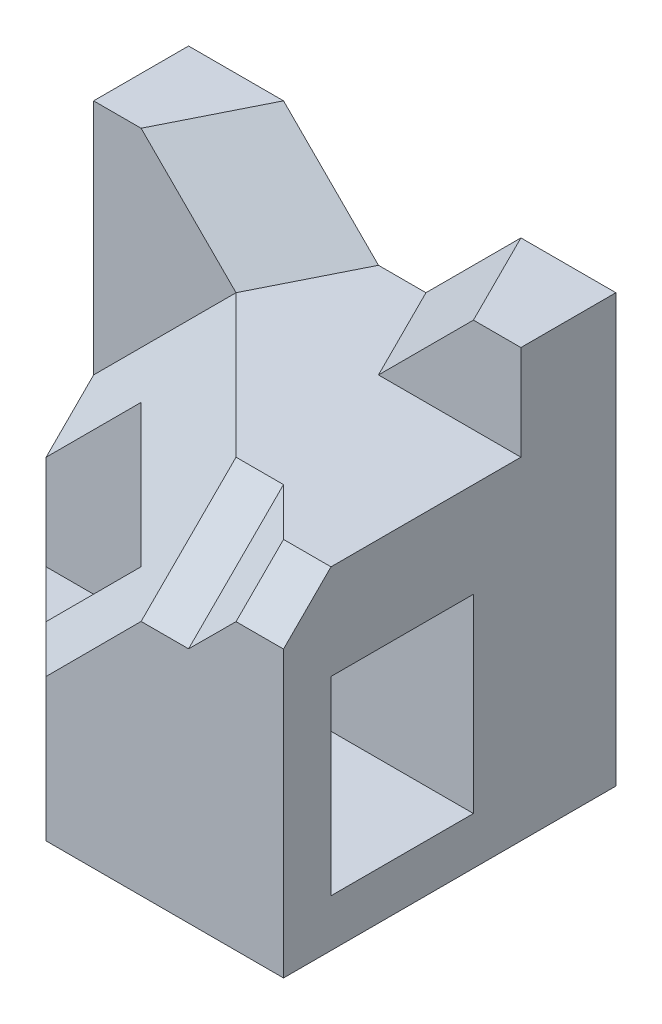
ISO-10303-21;
HEADER;
FILE_DESCRIPTION(('STEP AP214'),'2;1');
FILE_NAME('part.step','',(''),(''),'','','');
FILE_SCHEMA(('AUTOMOTIVE_DESIGN { 1 0 10303 214 1 1 1 1 }'));
ENDSEC;
DATA;
#1=APPLICATION_CONTEXT('core data for automotive mechanical design processes');
#2=APPLICATION_PROTOCOL_DEFINITION('international standard','automotive_design',2000,#1);
#3=PRODUCT_CONTEXT('',#1,'mechanical');
#4=PRODUCT('Part','Part','',(#3));
#5=PRODUCT_RELATED_PRODUCT_CATEGORY('part','',(#4));
#6=PRODUCT_DEFINITION_FORMATION('','',#4);
#7=PRODUCT_DEFINITION_CONTEXT('part definition',#1,'design');
#8=PRODUCT_DEFINITION('design','',#6,#7);
#9=PRODUCT_DEFINITION_SHAPE('','',#8);
#10=(LENGTH_UNIT() NAMED_UNIT(*) SI_UNIT(.MILLI.,.METRE.));
#11=(NAMED_UNIT(*) PLANE_ANGLE_UNIT() SI_UNIT($,.RADIAN.));
#12=(NAMED_UNIT(*) SI_UNIT($,.STERADIAN.) SOLID_ANGLE_UNIT());
#13=UNCERTAINTY_MEASURE_WITH_UNIT(LENGTH_MEASURE(1.E-05),#10,'distance_accuracy_value','');
#14=(GEOMETRIC_REPRESENTATION_CONTEXT(3) GLOBAL_UNCERTAINTY_ASSIGNED_CONTEXT((#13)) GLOBAL_UNIT_ASSIGNED_CONTEXT((#10,
#11,#12)) REPRESENTATION_CONTEXT('',''));
#15=CARTESIAN_POINT('',(0.,0.,0.));
#16=DIRECTION('',(0.,0.,1.));
#17=DIRECTION('',(1.,0.,0.));
#18=AXIS2_PLACEMENT_3D('',#15,#16,#17);
#19=CARTESIAN_POINT('',(0.,0.,0.));
#20=DIRECTION('',(0.,0.,-1.));
#21=DIRECTION('',(-1.,0.,0.));
#22=AXIS2_PLACEMENT_3D('',#19,#20,#21);
#23=PLANE('',#22);
#24=DIRECTION('',(-1.,0.,0.));
#25=VECTOR('',#24,1.);
#26=CARTESIAN_POINT('',(0.,9.,0.));
#27=LINE('',#26,#25);
#28=CARTESIAN_POINT('',(1.99997163141931,9.,0.));
#29=VERTEX_POINT('',#28);
#30=CARTESIAN_POINT('',(0.,9.,0.));
#31=VERTEX_POINT('',#30);
#32=EDGE_CURVE('E201',#29,#31,#27,.T.);
#33=ORIENTED_EDGE('',*,*,#32,.F.);
#34=DIRECTION('',(-0.707126839948758,0.707086721855306,0.));
#35=VECTOR('',#34,1.);
#36=CARTESIAN_POINT('',(5.4999148902344,5.50022693979315,0.));
#37=LINE('',#36,#35);
#38=CARTESIAN_POINT('',(4.00000373021469,7.00000816954081,1.86489580654951E-06));
#39=VERTEX_POINT('',#38);
#40=EDGE_CURVE('E182',#39,#29,#37,.T.);
#41=ORIENTED_EDGE('',*,*,#40,.F.);
#42=DIRECTION('',(-1.,0.,0.));
#43=VECTOR('',#42,1.);
#44=CARTESIAN_POINT('',(5.,7.,0.));
#45=LINE('',#44,#43);
#46=CARTESIAN_POINT('',(5.,7.,0.));
#47=VERTEX_POINT('',#46);
#48=EDGE_CURVE('E237',#47,#39,#45,.T.);
#49=ORIENTED_EDGE('',*,*,#48,.F.);
#50=DIRECTION('',(0.707106781186548,0.707106781186548,0.));
#51=VECTOR('',#50,1.);
#52=CARTESIAN_POINT('',(5.,7.,0.));
#53=LINE('',#52,#51);
#54=CARTESIAN_POINT('',(7.,9.,0.));
#55=VERTEX_POINT('',#54);
#56=EDGE_CURVE('E238',#47,#55,#53,.T.);
#57=ORIENTED_EDGE('',*,*,#56,.T.);
#58=CARTESIAN_POINT('',(9.,9.,0.));
#59=VERTEX_POINT('',#58);
#60=EDGE_CURVE('E211',#59,#55,#27,.T.);
#61=ORIENTED_EDGE('',*,*,#60,.F.);
#62=DIRECTION('',(0.,1.,0.));
#63=VECTOR('',#62,1.);
#64=CARTESIAN_POINT('',(9.,0.,0.));
#65=LINE('',#64,#63);
#66=CARTESIAN_POINT('',(9.,0.,0.));
#67=VERTEX_POINT('',#66);
#68=EDGE_CURVE('E212',#67,#59,#65,.T.);
#69=ORIENTED_EDGE('',*,*,#68,.F.);
#70=DIRECTION('',(1.,0.,0.));
#71=VECTOR('',#70,1.);
#72=CARTESIAN_POINT('',(0.,0.,0.));
#73=LINE('',#72,#71);
#74=CARTESIAN_POINT('',(0.,0.,0.));
#75=VERTEX_POINT('',#74);
#76=EDGE_CURVE('E217',#75,#67,#73,.T.);
#77=ORIENTED_EDGE('',*,*,#76,.F.);
#78=DIRECTION('',(0.,-1.,0.));
#79=VECTOR('',#78,1.);
#80=CARTESIAN_POINT('',(0.,0.,0.));
#81=LINE('',#80,#79);
#82=EDGE_CURVE('E210',#31,#75,#81,.T.);
#83=ORIENTED_EDGE('',*,*,#82,.F.);
#84=EDGE_LOOP('',(#33,#41,#49,#57,#61,#69,#77,#83));
#85=FACE_BOUND('',#84,.T.);
#86=ADVANCED_FACE('F37',(#85),#23,.T.);
#87=CARTESIAN_POINT('',(9.,0.,2.));
#88=DIRECTION('',(0.,0.,1.));
#89=DIRECTION('',(1.,0.,0.));
#90=AXIS2_PLACEMENT_3D('',#87,#88,#89);
#91=PLANE('',#90);
#92=CARTESIAN_POINT('',(3.00017517027437,6.99982487801862,1.99982491884711));
#93=CARTESIAN_POINT('',(2.87516638561221,6.87483366121717,1.99983369951884));
#94=CARTESIAN_POINT('',(2.75015994916233,6.74984009579196,1.99984013264376));
#95=CARTESIAN_POINT('',(2.50015099757981,6.49984904470538,1.9998490795714));
#96=CARTESIAN_POINT('',(2.37514848244714,6.37485155904402,1.99985159337415));
#97=CARTESIAN_POINT('',(2.12514659735498,6.1248534434599,1.99985347742897));
#98=CARTESIAN_POINT('',(2.00014722739547,5.99985281353715,1.99985284768105));
#99=CARTESIAN_POINT('',(1.75015101970587,5.7498490221786,1.99984905725326));
#100=CARTESIAN_POINT('',(1.62515418197577,5.62484586074283,1.99984589657339));
#101=CARTESIAN_POINT('',(1.37516253806116,5.37483750690068,1.99983754470911));
#102=CARTESIAN_POINT('',(1.25016773187664,5.24983231449432,1.99983235352471));
#103=CARTESIAN_POINT('',(1.00017976245665,4.99982028719377,1.99982032904688));
#104=CARTESIAN_POINT('',(0.87518659922118,4.87481345229959,1.99981349575345));
#105=CARTESIAN_POINT('',(0.625201615685915,4.62479843995198,1.99979848691726));
#106=CARTESIAN_POINT('',(0.500209795386123,4.49979026249856,1.9997903113745));
#107=CARTESIAN_POINT('',(0.250227276549569,4.24977278613794,1.99977283909666));
#108=CARTESIAN_POINT('',(0.125236578012808,4.12476348723074,1.99976354236159));
#109=CARTESIAN_POINT('',(0.000246329766466798,3.99975373814463,1.99975379555887));
#110=B_SPLINE_CURVE_WITH_KNOTS('',3,(#92,#93,#94,#95,#96,#97,#98,#99,#100,#101,#102,#103,#104,
#105,#106,#107,#108,#109),.UNSPECIFIED.,.F.,.F.,(4,2,2,2,2,2,2,2,4),(0.,0.530330090826574,
1.06066017844096,1.59099026402922,2.1213203483597,2.65165043191931,3.18198051501199,
3.71231059782671,4.2426406804822),.UNSPECIFIED.);
#111=CARTESIAN_POINT('',(6.1582441616766E-05,3.99993843453616,1.99993844888972));
#112=VERTEX_POINT('',#111);
#113=CARTESIAN_POINT('',(3.00025075529413,7.,1.9999522681231));
#114=VERTEX_POINT('',#113);
#115=EDGE_CURVE('E670',#112,#114,#110,.F.);
#116=ORIENTED_EDGE('',*,*,#115,.T.);
#117=DIRECTION('',(0.707126839948758,-0.707086721855306,0.));
#118=VECTOR('',#117,1.);
#119=CARTESIAN_POINT('',(4.99999996366277,5.00028364946765,2.));
#120=LINE('',#119,#118);
#121=CARTESIAN_POINT('',(1.00002831199764,9.,2.));
#122=VERTEX_POINT('',#121);
#123=EDGE_CURVE('E204',#122,#114,#120,.T.);
#124=ORIENTED_EDGE('',*,*,#123,.F.);
#125=DIRECTION('',(-1.,0.,0.));
#126=VECTOR('',#125,1.);
#127=CARTESIAN_POINT('',(9.,9.,2.));
#128=LINE('',#127,#126);
#129=CARTESIAN_POINT('',(0.,8.99973269659745,1.99979575748822));
#130=VERTEX_POINT('',#129);
#131=EDGE_CURVE('E203',#122,#130,#128,.T.);
#132=ORIENTED_EDGE('',*,*,#131,.T.);
#133=DIRECTION('',(0.,1.,0.));
#134=VECTOR('',#133,1.);
#135=CARTESIAN_POINT('',(0.,0.,2.));
#136=LINE('',#135,#134);
#137=EDGE_CURVE('E516',#112,#130,#136,.T.);
#138=ORIENTED_EDGE('',*,*,#137,.F.);
#139=EDGE_LOOP('',(#116,#124,#132,#138));
#140=FACE_BOUND('',#139,.T.);
#141=ADVANCED_FACE('F386',(#140),#91,.T.);
#142=CARTESIAN_POINT('',(0.,9.,7.));
#143=DIRECTION('',(0.,-1.,0.));
#144=DIRECTION('',(0.,0.,-1.));
#145=AXIS2_PLACEMENT_3D('',#142,#143,#144);
#146=PLANE('',#145);
#147=DIRECTION('',(0.447213595499958,0.,0.894427190999916));
#148=VECTOR('',#147,1.);
#149=CARTESIAN_POINT('',(7.,9.,0.));
#150=LINE('',#149,#148);
#151=CARTESIAN_POINT('',(8.,9.,2.));
#152=VERTEX_POINT('',#151);
#153=EDGE_CURVE('E242',#55,#152,#150,.T.);
#154=ORIENTED_EDGE('',*,*,#153,.T.);
#155=CARTESIAN_POINT('',(9.,9.,2.));
#156=VERTEX_POINT('',#155);
#157=EDGE_CURVE('E485',#156,#152,#128,.T.);
#158=ORIENTED_EDGE('',*,*,#157,.F.);
#159=DIRECTION('',(0.,0.,-1.));
#160=VECTOR('',#159,1.);
#161=CARTESIAN_POINT('',(9.,9.,7.));
#162=LINE('',#161,#160);
#163=EDGE_CURVE('E226',#156,#59,#162,.T.);
#164=ORIENTED_EDGE('',*,*,#163,.T.);
#165=ORIENTED_EDGE('',*,*,#60,.T.);
#166=EDGE_LOOP('',(#154,#158,#164,#165));
#167=FACE_BOUND('',#166,.T.);
#168=ADVANCED_FACE('F392',(#167),#146,.F.);
#169=ORIENTED_EDGE('',*,*,#157,.T.);
#170=DIRECTION('',(-0.707106781186548,-0.707106781186547,0.));
#171=VECTOR('',#170,1.);
#172=CARTESIAN_POINT('',(8.,9.,2.));
#173=LINE('',#172,#171);
#174=CARTESIAN_POINT('',(6.,7.,2.));
#175=VERTEX_POINT('',#174);
#176=EDGE_CURVE('E195',#152,#175,#173,.T.);
#177=ORIENTED_EDGE('',*,*,#176,.T.);
#178=DIRECTION('',(-1.,0.,0.));
#179=VECTOR('',#178,1.);
#180=CARTESIAN_POINT('',(9.,7.,2.));
#181=LINE('',#180,#179);
#182=CARTESIAN_POINT('',(9.,7.,2.));
#183=VERTEX_POINT('',#182);
#184=EDGE_CURVE('E495',#183,#175,#181,.T.);
#185=ORIENTED_EDGE('',*,*,#184,.F.);
#186=DIRECTION('',(0.,1.,0.));
#187=VECTOR('',#186,1.);
#188=CARTESIAN_POINT('',(9.,0.,2.));
#189=LINE('',#188,#187);
#190=EDGE_CURVE('E551',#183,#156,#189,.T.);
#191=ORIENTED_EDGE('',*,*,#190,.T.);
#192=EDGE_LOOP('',(#169,#177,#185,#191));
#193=FACE_BOUND('',#192,.T.);
#194=ADVANCED_FACE('F395',(#193),#91,.T.);
#195=CARTESIAN_POINT('',(9.,7.,0.));
#196=DIRECTION('',(0.,-1.,0.));
#197=DIRECTION('',(0.,0.,-1.));
#198=AXIS2_PLACEMENT_3D('',#195,#196,#197);
#199=PLANE('',#198);
#200=CARTESIAN_POINT('',(5.9997333673606,7.00026655913096,5.00045307900127));
#201=CARTESIAN_POINT('',(5.87477463664155,7.00022530218372,4.87540405837854));
#202=CARTESIAN_POINT('',(5.74981143093044,7.00018851789907,4.75035950827949));
#203=CARTESIAN_POINT('',(5.49987721366749,7.00012275301848,4.50027820995075));
#204=CARTESIAN_POINT('',(5.37490620211574,7.00009377242246,4.37524146172096));
#205=CARTESIAN_POINT('',(5.12495751518401,7.00004247328198,4.12517462582026));
#206=CARTESIAN_POINT('',(4.99997983980406,7.00002015473749,4.0001445381493));
#207=CARTESIAN_POINT('',(4.75001913521606,6.99998087003998,3.75008971399039));
#208=CARTESIAN_POINT('',(4.625036106008,6.99996390388697,3.62506497750242));
#209=CARTESIAN_POINT('',(4.37506604114061,6.99993397696073,3.37501950900553));
#210=CARTESIAN_POINT('',(4.25007900548128,6.9999210161875,3.2499987769966));
#211=CARTESIAN_POINT('',(4.00010225533964,6.99989777274498,2.99995999047778));
#212=CARTESIAN_POINT('',(3.87511254085733,6.99988749007569,2.87494193596789));
#213=CARTESIAN_POINT('',(3.62513168824125,6.99986834800272,2.62490724988855));
#214=CARTESIAN_POINT('',(3.50014055010749,6.99985948859905,2.49989061831912));
#215=CARTESIAN_POINT('',(3.25015788906711,6.99984215445847,2.24985773975734));
#216=CARTESIAN_POINT('',(3.12516636616049,6.99983367972157,2.12484149276499));
#217=CARTESIAN_POINT('',(3.00017517027437,6.99982487801862,1.99982491884711));
#218=B_SPLINE_CURVE_WITH_KNOTS('',3,(#200,#201,#202,#203,#204,#205,#206,#207,#208,#209,#210,
#211,#212,#213,#214,#215,#216,#217),.UNSPECIFIED.,.F.,.F.,(4,2,2,2,2,2,2,2,4),(0.,
0.530346577585294,1.06069314942589,1.59103971882098,2.12138628787573,2.65173285762987,
3.18207942831211,3.71242599965195,4.24277257118319),.UNSPECIFIED.);
#219=CARTESIAN_POINT('',(5.9998666836803,7.00013327956548,5.000319830509));
#220=VERTEX_POINT('',#219);
#221=EDGE_CURVE('E291',#114,#220,#218,.F.);
#222=ORIENTED_EDGE('',*,*,#221,.T.);
#223=DIRECTION('',(1.,0.,0.));
#224=VECTOR('',#223,1.);
#225=CARTESIAN_POINT('',(9.,7.,5.00018658201672));
#226=LINE('',#225,#224);
#227=CARTESIAN_POINT('',(6.99972013216606,7.00004665991355,5.00013982640819));
#228=VERTEX_POINT('',#227);
#229=EDGE_CURVE('E538',#220,#228,#226,.T.);
#230=ORIENTED_EDGE('',*,*,#229,.T.);
#231=CARTESIAN_POINT('',(8.0002481119491,6.99975114712771,5.99975151758931));
#232=DIRECTION('',(-0.70745779551293,0.000351931172223481,-0.706755504904232));
#233=VECTOR('',#232,1.);
#234=LINE('',#231,#233);
#235=CARTESIAN_POINT('',(8.00024866833293,6.99993778678193,5.99993787939733));
#236=VERTEX_POINT('',#235);
#237=EDGE_CURVE('E535',#236,#228,#234,.T.);
#238=ORIENTED_EDGE('',*,*,#237,.F.);
#239=DIRECTION('',(1.,0.,0.));
#240=VECTOR('',#239,1.);
#241=CARTESIAN_POINT('',(8.,7.,6.));
#242=LINE('',#241,#240);
#243=CARTESIAN_POINT('',(9.,7.,6.));
#244=VERTEX_POINT('',#243);
#245=EDGE_CURVE('E510',#236,#244,#242,.T.);
#246=ORIENTED_EDGE('',*,*,#245,.T.);
#247=DIRECTION('',(0.,0.,1.));
#248=VECTOR('',#247,1.);
#249=CARTESIAN_POINT('',(9.,7.,0.));
#250=LINE('',#249,#248);
#251=EDGE_CURVE('E500',#183,#244,#250,.T.);
#252=ORIENTED_EDGE('',*,*,#251,.F.);
#253=ORIENTED_EDGE('',*,*,#184,.T.);
#254=DIRECTION('',(-0.447213595499958,0.,-0.894427190999916));
#255=VECTOR('',#254,1.);
#256=CARTESIAN_POINT('',(6.,7.,2.));
#257=LINE('',#256,#255);
#258=EDGE_CURVE('E231',#175,#47,#257,.T.);
#259=ORIENTED_EDGE('',*,*,#258,.T.);
#260=ORIENTED_EDGE('',*,*,#48,.T.);
#261=CARTESIAN_POINT('',(4.,7.,0.));
#262=DIRECTION('',(-0.447213596463986,0.,0.894427190517902));
#263=VECTOR('',#262,1.);
#264=LINE('',#261,#263);
#265=EDGE_CURVE('E189',#39,#114,#264,.T.);
#266=ORIENTED_EDGE('',*,*,#265,.T.);
#267=EDGE_LOOP('',(#222,#230,#238,#246,#252,#253,#259,#260,#266));
#268=FACE_BOUND('',#267,.T.);
#269=ADVANCED_FACE('F404',(#268),#199,.F.);
#270=ORIENTED_EDGE('',*,*,#131,.F.);
#271=CARTESIAN_POINT('',(1.99997478412008,8.9999747826894,-1.26065099982295E-05));
#272=DIRECTION('',(-0.447191062231246,2.25550480460003E-05,0.894438456995091));
#273=VECTOR('',#272,1.);
#274=LINE('',#271,#273);
#275=EDGE_CURVE('E185',#29,#122,#274,.T.);
#276=ORIENTED_EDGE('',*,*,#275,.F.);
#277=ORIENTED_EDGE('',*,*,#32,.T.);
#278=DIRECTION('',(0.,0.,-1.));
#279=VECTOR('',#278,1.);
#280=CARTESIAN_POINT('',(0.,9.,7.));
#281=LINE('',#280,#279);
#282=EDGE_CURVE('E466',#130,#31,#281,.T.);
#283=ORIENTED_EDGE('',*,*,#282,.F.);
#284=EDGE_LOOP('',(#270,#276,#277,#283));
#285=FACE_BOUND('',#284,.T.);
#286=ADVANCED_FACE('F199',(#285),#146,.F.);
#287=CARTESIAN_POINT('',(0.,0.,7.));
#288=DIRECTION('',(1.,0.,0.));
#289=DIRECTION('',(0.,0.,-1.));
#290=AXIS2_PLACEMENT_3D('',#287,#288,#289);
#291=PLANE('',#290);
#292=DIRECTION('',(0.,1.,0.));
#293=VECTOR('',#292,1.);
#294=CARTESIAN_POINT('',(0.,0.,3.));
#295=LINE('',#294,#293);
#296=CARTESIAN_POINT('',(0.,0.,3.));
#297=VERTEX_POINT('',#296);
#298=CARTESIAN_POINT('',(0.,1.,3.));
#299=VERTEX_POINT('',#298);
#300=EDGE_CURVE('E454',#297,#299,#295,.T.);
#301=ORIENTED_EDGE('',*,*,#300,.T.);
#302=DIRECTION('',(0.,-1.,0.));
#303=VECTOR('',#302,1.);
#304=CARTESIAN_POINT('',(0.,1.,3.));
#305=LINE('',#304,#303);
#306=CARTESIAN_POINT('',(0.,2.99944832592936,3.));
#307=VERTEX_POINT('',#306);
#308=EDGE_CURVE('E234',#307,#299,#305,.T.);
#309=ORIENTED_EDGE('',*,*,#308,.F.);
#310=CARTESIAN_POINT('',(0.000246329766467263,3.99975373814463,1.99975379555887));
#311=CARTESIAN_POINT('',(0.000244861819286029,3.95808853900993,2.04142192943638));
#312=CARTESIAN_POINT('',(0.000243548403751526,3.91642318539582,2.08308990885123));
#313=CARTESIAN_POINT('',(0.000241247491778597,3.83309215233837,2.16642554192766));
#314=CARTESIAN_POINT('',(0.000240259995340363,3.79142647289502,2.20809319558923));
#315=CARTESIAN_POINT('',(0.00023862777736377,3.70809477132778,2.29142816031201));
#316=CARTESIAN_POINT('',(0.000237983055825658,3.66642874920389,2.33309547137321));
#317=CARTESIAN_POINT('',(0.000237053764482229,3.58309634490356,2.41642973352724));
#318=CARTESIAN_POINT('',(0.000236769194677224,3.54142996272711,2.45809668462007));
#319=CARTESIAN_POINT('',(0.00023657813748802,3.45809682039589,2.54143020891579));
#320=CARTESIAN_POINT('',(0.000236671650104211,3.41643006024111,2.58309678211869));
#321=CARTESIAN_POINT('',(0.000237255429844482,3.33309614328629,2.66642953197199));
#322=CARTESIAN_POINT('',(0.000237745696969044,3.29142898648624,2.70809570862238));
#323=CARTESIAN_POINT('',(0.00023914242214759,3.20809425680974,2.7914276459442));
#324=CARTESIAN_POINT('',(0.000240048880202163,3.16642668393329,2.83309340661563));
#325=CARTESIAN_POINT('',(0.0002422986781264,3.083091101419,2.91642449129895));
#326=CARTESIAN_POINT('',(0.000243642017996782,3.04142309178117,2.95808981531084));
#327=CARTESIAN_POINT('',(0.000245214144216366,2.99975485345931,2.99975491061353));
#328=B_SPLINE_CURVE_WITH_KNOTS('',3,(#310,#311,#312,#313,#314,#315,#316,#317,#318,#319,#320,
#321,#322,#323,#324,#325,#326,#327),.UNSPECIFIED.,.F.,.F.,(4,2,2,2,2,2,2,2,4),(0.,
0.176776694779735,0.353553389663515,0.530330084674253,0.707106779837719,0.883883475182842,
1.06066017074208,1.2374368665518,1.41421356265278),.UNSPECIFIED.);
#329=EDGE_CURVE('E668',#307,#112,#328,.F.);
#330=ORIENTED_EDGE('',*,*,#329,.T.);
#331=ORIENTED_EDGE('',*,*,#137,.T.);
#332=ORIENTED_EDGE('',*,*,#282,.T.);
#333=ORIENTED_EDGE('',*,*,#82,.T.);
#334=DIRECTION('',(0.,0.,-1.));
#335=VECTOR('',#334,1.);
#336=CARTESIAN_POINT('',(0.,0.,7.));
#337=LINE('',#336,#335);
#338=EDGE_CURVE('E476',#297,#75,#337,.T.);
#339=ORIENTED_EDGE('',*,*,#338,.F.);
#340=EDGE_LOOP('',(#301,#309,#330,#331,#332,#333,#339));
#341=FACE_BOUND('',#340,.T.);
#342=ADVANCED_FACE('F39',(#341),#291,.F.);
#343=CARTESIAN_POINT('',(0.,0.,7.));
#344=DIRECTION('',(0.,1.,0.));
#345=DIRECTION('',(0.,0.,1.));
#346=AXIS2_PLACEMENT_3D('',#343,#344,#345);
#347=PLANE('',#346);
#348=DIRECTION('',(1.,0.,0.));
#349=VECTOR('',#348,1.);
#350=CARTESIAN_POINT('',(0.,0.,7.));
#351=LINE('',#350,#349);
#352=CARTESIAN_POINT('',(4.,0.,7.));
#353=VERTEX_POINT('',#352);
#354=CARTESIAN_POINT('',(9.,0.,7.));
#355=VERTEX_POINT('',#354);
#356=EDGE_CURVE('E214',#353,#355,#351,.T.);
#357=ORIENTED_EDGE('',*,*,#356,.F.);
#358=DIRECTION('',(-0.707106781186548,0.,-0.707106781186548));
#359=VECTOR('',#358,1.);
#360=CARTESIAN_POINT('',(0.,0.,3.));
#361=LINE('',#360,#359);
#362=EDGE_CURVE('E455',#353,#297,#361,.T.);
#363=ORIENTED_EDGE('',*,*,#362,.T.);
#364=ORIENTED_EDGE('',*,*,#338,.T.);
#365=ORIENTED_EDGE('',*,*,#76,.T.);
#366=DIRECTION('',(0.,0.,-1.));
#367=VECTOR('',#366,1.);
#368=CARTESIAN_POINT('',(9.,0.,7.));
#369=LINE('',#368,#367);
#370=EDGE_CURVE('E472',#355,#67,#369,.T.);
#371=ORIENTED_EDGE('',*,*,#370,.F.);
#372=EDGE_LOOP('',(#357,#363,#364,#365,#371));
#373=FACE_BOUND('',#372,.T.);
#374=ADVANCED_FACE('F471',(#373),#347,.F.);
#375=CARTESIAN_POINT('',(9.,0.,7.));
#376=DIRECTION('',(-1.,0.,0.));
#377=DIRECTION('',(0.,0.,1.));
#378=AXIS2_PLACEMENT_3D('',#375,#376,#377);
#379=PLANE('',#378);
#380=DIRECTION('',(0.,0.,-1.));
#381=VECTOR('',#380,1.);
#382=CARTESIAN_POINT('',(9.,5.,7.));
#383=LINE('',#382,#381);
#384=CARTESIAN_POINT('',(9.,5.,6.));
#385=VERTEX_POINT('',#384);
#386=CARTESIAN_POINT('',(9.,5.,3.));
#387=VERTEX_POINT('',#386);
#388=EDGE_CURVE('E276',#385,#387,#383,.T.);
#389=ORIENTED_EDGE('',*,*,#388,.T.);
#390=DIRECTION('',(0.,-1.,0.));
#391=VECTOR('',#390,1.);
#392=CARTESIAN_POINT('',(9.,0.,3.));
#393=LINE('',#392,#391);
#394=CARTESIAN_POINT('',(9.,1.,3.));
#395=VERTEX_POINT('',#394);
#396=EDGE_CURVE('E279',#387,#395,#393,.T.);
#397=ORIENTED_EDGE('',*,*,#396,.T.);
#398=DIRECTION('',(0.,0.,1.));
#399=VECTOR('',#398,1.);
#400=CARTESIAN_POINT('',(9.,1.,7.));
#401=LINE('',#400,#399);
#402=CARTESIAN_POINT('',(9.,1.,6.));
#403=VERTEX_POINT('',#402);
#404=EDGE_CURVE('E282',#395,#403,#401,.T.);
#405=ORIENTED_EDGE('',*,*,#404,.T.);
#406=DIRECTION('',(0.,1.,0.));
#407=VECTOR('',#406,1.);
#408=CARTESIAN_POINT('',(9.,0.,6.));
#409=LINE('',#408,#407);
#410=EDGE_CURVE('E271',#403,#385,#409,.T.);
#411=ORIENTED_EDGE('',*,*,#410,.T.);
#412=EDGE_LOOP('',(#389,#397,#405,#411));
#413=FACE_BOUND('',#412,.T.);
#414=ORIENTED_EDGE('',*,*,#251,.T.);
#415=DIRECTION('',(0.,0.707106781186548,-0.707106781186548));
#416=VECTOR('',#415,1.);
#417=CARTESIAN_POINT('',(9.,7.,6.));
#418=LINE('',#417,#416);
#419=CARTESIAN_POINT('',(9.,6.,7.));
#420=VERTEX_POINT('',#419);
#421=EDGE_CURVE('E543',#420,#244,#418,.T.);
#422=ORIENTED_EDGE('',*,*,#421,.F.);
#423=DIRECTION('',(0.,1.,0.));
#424=VECTOR('',#423,1.);
#425=CARTESIAN_POINT('',(9.,0.,7.));
#426=LINE('',#425,#424);
#427=EDGE_CURVE('E463',#355,#420,#426,.T.);
#428=ORIENTED_EDGE('',*,*,#427,.F.);
#429=ORIENTED_EDGE('',*,*,#370,.T.);
#430=ORIENTED_EDGE('',*,*,#68,.T.);
#431=ORIENTED_EDGE('',*,*,#163,.F.);
#432=ORIENTED_EDGE('',*,*,#190,.F.);
#433=EDGE_LOOP('',(#414,#422,#428,#429,#430,#431,#432));
#434=FACE_BOUND('',#433,.T.);
#435=ADVANCED_FACE('F405',(#413,#434),#379,.F.);
#436=CARTESIAN_POINT('',(0.,0.,7.));
#437=DIRECTION('',(0.,0.,-1.));
#438=DIRECTION('',(-1.,0.,0.));
#439=AXIS2_PLACEMENT_3D('',#436,#437,#438);
#440=PLANE('',#439);
#441=DIRECTION('',(-1.,0.,0.));
#442=VECTOR('',#441,1.);
#443=CARTESIAN_POINT('',(0.,5.00435981148772,7.));
#444=LINE('',#443,#442);
#445=CARTESIAN_POINT('',(7.00006202798727,5.0043416051925,6.99993787939733));
#446=VERTEX_POINT('',#445);
#447=CARTESIAN_POINT('',(6.0004214501621,5.00434293330014,6.99994241095778));
#448=VERTEX_POINT('',#447);
#449=EDGE_CURVE('E542',#446,#448,#444,.T.);
#450=ORIENTED_EDGE('',*,*,#449,.T.);
#451=CARTESIAN_POINT('',(3.99973137596697,3.00026854997559,7.00026848736502));
#452=CARTESIAN_POINT('',(4.08308251985944,3.08376573619767,7.00025068573041));
#453=CARTESIAN_POINT('',(4.16643382107128,3.16726276535022,7.00023272695955));
#454=CARTESIAN_POINT('',(4.33313708399056,3.33425616334182,7.00019614925828));
#455=CARTESIAN_POINT('',(4.41648904569799,3.41775253218087,7.00017753032787));
#456=CARTESIAN_POINT('',(4.58319397567066,3.58474426357678,7.0001392864204));
#457=CARTESIAN_POINT('',(4.66654694393589,3.66823962613365,7.00011966144336));
#458=CARTESIAN_POINT('',(4.83325428100634,3.83522895109797,7.00007901166406));
#459=CARTESIAN_POINT('',(4.91660864981156,3.91872291350543,7.00005798686182));
#460=CARTESIAN_POINT('',(5.08331920972111,4.08570901653434,7.00001411589068));
#461=CARTESIAN_POINT('',(5.16667540082543,4.16920115715581,6.99999126972181));
#462=CARTESIAN_POINT('',(5.33339004879643,4.33618317327574,6.99994331278181));
#463=CARTESIAN_POINT('',(5.41674850566307,4.41967304877425,6.99991820201071));
#464=CARTESIAN_POINT('',(5.58346813940648,4.58665008054166,6.99986526185756));
#465=CARTESIAN_POINT('',(5.6668293162832,4.67013723681062,6.99983743247555));
#466=CARTESIAN_POINT('',(5.83355483132231,4.83710838893441,6.99977861403423));
#467=CARTESIAN_POINT('',(5.91691916948464,4.92059238478929,6.99974762497497));
#468=CARTESIAN_POINT('',(6.00028530961349,5.00407458053176,6.99971483554365));
#469=B_SPLINE_CURVE_WITH_KNOTS('',3,(#451,#452,#453,#454,#455,#456,#457,#458,#459,#460,#461,
#462,#463,#464,#465,#466,#467,#468),.UNSPECIFIED.,.F.,.F.,(4,2,2,2,2,2,2,2,4),(0.,
0.353938896583837,0.707877791427766,1.06181668366392,1.41575557241788,1.76969445687187,
2.12363333633971,2.4775722103478,2.83151107871382),.UNSPECIFIED.);
#470=CARTESIAN_POINT('',(4.,3.00040310775324,7.));
#471=VERTEX_POINT('',#470);
#472=EDGE_CURVE('E626',#448,#471,#469,.F.);
#473=ORIENTED_EDGE('',*,*,#472,.T.);
#474=DIRECTION('',(0.,1.,0.));
#475=VECTOR('',#474,1.);
#476=CARTESIAN_POINT('',(4.,0.,7.));
#477=LINE('',#476,#475);
#478=EDGE_CURVE('E445',#353,#471,#477,.T.);
#479=ORIENTED_EDGE('',*,*,#478,.F.);
#480=ORIENTED_EDGE('',*,*,#356,.T.);
#481=ORIENTED_EDGE('',*,*,#427,.T.);
#482=DIRECTION('',(1.,0.,0.));
#483=VECTOR('',#482,1.);
#484=CARTESIAN_POINT('',(8.,6.,7.));
#485=LINE('',#484,#483);
#486=CARTESIAN_POINT('',(7.999966475769,6.00005813424851,7.0000335742868));
#487=VERTEX_POINT('',#486);
#488=EDGE_CURVE('E508',#487,#420,#485,.T.);
#489=ORIENTED_EDGE('',*,*,#488,.F.);
#490=CARTESIAN_POINT('',(7.0002481119491,5.00421717875635,6.99975151758931));
#491=DIRECTION('',(0.708335984899134,0.705875349093012,0.000352192832720101));
#492=VECTOR('',#491,1.);
#493=LINE('',#490,#492);
#494=EDGE_CURVE('E547',#446,#487,#493,.T.);
#495=ORIENTED_EDGE('',*,*,#494,.F.);
#496=EDGE_LOOP('',(#450,#473,#479,#480,#481,#489,#495));
#497=FACE_BOUND('',#496,.T.);
#498=ADVANCED_FACE('F398',(#497),#440,.F.);
#499=CARTESIAN_POINT('',(0.,0.,3.));
#500=DIRECTION('',(0.707106781186547,0.,-0.707106781186547));
#501=DIRECTION('',(-0.707106781186548,0.,-0.707106781186548));
#502=AXIS2_PLACEMENT_3D('',#499,#500,#501);
#503=PLANE('',#502);
#504=CARTESIAN_POINT('',(2.99997402313478,3.00001731621404,6.00000865630096));
#505=CARTESIAN_POINT('',(3.00278186491117,3.00001780846298,6.00281748259621));
#506=CARTESIAN_POINT('',(3.00558970516359,3.00001830223545,6.00562631041462));
#507=CARTESIAN_POINT('',(3.01120538260589,3.0000192928421,6.01124396911244));
#508=CARTESIAN_POINT('',(3.01401321979575,3.00001978967629,6.01405279999186));
#509=CARTESIAN_POINT('',(3.01962889109825,3.00002078642104,6.01967046482635));
#510=CARTESIAN_POINT('',(3.02243672521088,3.00002128633161,6.02247929878143));
#511=CARTESIAN_POINT('',(3.02805239034427,3.00002228924377,6.02809696978189));
#512=CARTESIAN_POINT('',(3.03086022136503,3.00002279224536,6.03090580682727));
#513=CARTESIAN_POINT('',(3.03647588030005,3.00002380135419,6.03652348402295));
#514=CARTESIAN_POINT('',(3.03928370821431,3.00002430746142,6.03933232417325));
#515=CARTESIAN_POINT('',(3.04489936092173,3.00002532279613,6.04495000759336));
#516=CARTESIAN_POINT('',(3.04770718571489,3.0000258320236,6.04775885086317));
#517=CARTESIAN_POINT('',(3.05332283216553,3.00002685361336,6.05337654053687));
#518=CARTESIAN_POINT('',(3.056130653823,3.00002736597565,6.05618538694077));
#519=CARTESIAN_POINT('',(3.06174629398773,3.00002839384959,6.06180308289719));
#520=CARTESIAN_POINT('',(3.06455411249498,3.00002890936124,6.06461193244972));
#521=CARTESIAN_POINT('',(3.0673619294198,3.00002942645485,6.0674207835838));
#522=B_SPLINE_CURVE_WITH_KNOTS('',3,(#504,#505,#506,#507,#508,#509,#510,#511,#512,#513,#514,
#515,#516,#517,#518,#519,#520,#521),.UNSPECIFIED.,.F.,.F.,(4,2,2,2,2,2,2,2,4),(0.,
0.0119147525179406,0.023829505036012,0.0357442575542371,0.0476590100726356,0.0595737625912367,
0.0714885151100542,0.083403267629119,0.0953180201484527),.UNSPECIFIED.);
#523=CARTESIAN_POINT('',(3.06738399242424,3.0000515202883,6.06739870596524));
#524=VERTEX_POINT('',#523);
#525=CARTESIAN_POINT('',(2.99997402524674,3.0000305423762,5.99999999860433));
#526=VERTEX_POINT('',#525);
#527=EDGE_CURVE('E633',#524,#526,#522,.F.);
#528=ORIENTED_EDGE('',*,*,#527,.T.);
#529=DIRECTION('',(0.,-1.,0.));
#530=VECTOR('',#529,1.);
#531=CARTESIAN_POINT('',(3.,0.,6.));
#532=LINE('',#531,#530);
#533=CARTESIAN_POINT('',(3.,1.,6.));
#534=VERTEX_POINT('',#533);
#535=EDGE_CURVE('E62',#526,#534,#532,.T.);
#536=ORIENTED_EDGE('',*,*,#535,.T.);
#537=DIRECTION('',(-0.707106781186548,0.,-0.707106781186548));
#538=VECTOR('',#537,1.);
#539=CARTESIAN_POINT('',(0.,1.,3.));
#540=LINE('',#539,#538);
#541=EDGE_CURVE('E12',#534,#299,#540,.T.);
#542=ORIENTED_EDGE('',*,*,#541,.T.);
#543=ORIENTED_EDGE('',*,*,#300,.F.);
#544=ORIENTED_EDGE('',*,*,#362,.F.);
#545=ORIENTED_EDGE('',*,*,#478,.T.);
#546=CARTESIAN_POINT('',(3.06736192941979,3.00002942645485,6.0674207835838));
#547=CARTESIAN_POINT('',(3.10621346582643,3.00003658125092,6.10628662988754));
#548=CARTESIAN_POINT('',(3.14506469890337,3.00004403928749,6.14515277935551));
#549=CARTESIAN_POINT('',(3.22276652119916,3.0000595990412,6.22288572182195));
#550=CARTESIAN_POINT('',(3.26161711041801,3.00006770075834,6.26175251482042));
#551=CARTESIAN_POINT('',(3.33931760778838,3.00008458507279,6.33948678153938));
#552=CARTESIAN_POINT('',(3.37816751593989,3.00009336767009,6.37835425525985));
#553=CARTESIAN_POINT('',(3.4558666154916,3.00011164941884,6.45608991908832));
#554=CARTESIAN_POINT('',(3.4947158068918,3.00012114857029,6.49495810919631));
#555=CARTESIAN_POINT('',(3.57241343861113,3.00014089774764,6.57269524011214));
#556=CARTESIAN_POINT('',(3.61126187893027,3.00015114777353,6.61156418091998));
#557=CARTESIAN_POINT('',(3.68895797585873,3.0001724313195,6.68930284584758));
#558=CARTESIAN_POINT('',(3.72780563246804,3.00018346483957,6.72817256996733));
#559=CARTESIAN_POINT('',(3.8055001310183,3.00020634632399,6.80591283246174));
#560=CARTESIAN_POINT('',(3.84434697295924,3.00021819428834,6.84478337083639));
#561=CARTESIAN_POINT('',(3.92203981384571,3.00024273298004,6.92252529015223));
#562=CARTESIAN_POINT('',(3.96088581279124,3.0002554237074,6.9613966710934));
#563=CARTESIAN_POINT('',(3.99973137596697,3.00026854997558,7.00026848736502));
#564=B_SPLINE_CURVE_WITH_KNOTS('',3,(#546,#547,#548,#549,#550,#551,#552,#553,#554,#555,#556,
#557,#558,#559,#560,#561,#562,#563),.UNSPECIFIED.,.F.,.F.,(4,2,2,2,2,2,2,2,4),(0.,
0.164863469183315,0.329726938492541,0.494590408008718,0.659453877824644,0.824317348044821,
0.989180818785192,1.15404429017268,1.31890776234447),.UNSPECIFIED.);
#565=EDGE_CURVE('E631',#471,#524,#564,.F.);
#566=ORIENTED_EDGE('',*,*,#565,.T.);
#567=EDGE_LOOP('',(#528,#536,#542,#543,#544,#545,#566));
#568=FACE_BOUND('',#567,.T.);
#569=ADVANCED_FACE('F630',(#568),#503,.F.);
#570=CARTESIAN_POINT('',(8.,7.,6.));
#571=DIRECTION('',(0.,-0.707106781186547,-0.707106781186547));
#572=DIRECTION('',(0.,0.707106781186548,-0.707106781186548));
#573=AXIS2_PLACEMENT_3D('',#570,#571,#572);
#574=PLANE('',#573);
#575=ORIENTED_EDGE('',*,*,#245,.F.);
#576=CARTESIAN_POINT('',(8.00000000000001,6.50000000000274,6.49999999999726));
#577=DIRECTION('',(0.000350883348391409,0.706754980992315,-0.707458319424846));
#578=VECTOR('',#577,1.);
#579=LINE('',#576,#578);
#580=CARTESIAN_POINT('',(8.,6.50000000000274,6.49999999999726));
#581=VERTEX_POINT('',#580);
#582=EDGE_CURVE('E524',#581,#236,#579,.T.);
#583=ORIENTED_EDGE('',*,*,#582,.F.);
#584=CARTESIAN_POINT('',(7.99975188805091,6.0002488528723,7.0002484824107));
#585=DIRECTION('',(0.00035088334839247,0.706754980992316,-0.707458319424846));
#586=VECTOR('',#585,1.);
#587=LINE('',#584,#586);
#588=EDGE_CURVE('E511',#487,#581,#587,.T.);
#589=ORIENTED_EDGE('',*,*,#588,.F.);
#590=ORIENTED_EDGE('',*,*,#488,.T.);
#591=ORIENTED_EDGE('',*,*,#421,.T.);
#592=EDGE_LOOP('',(#575,#583,#589,#590,#591));
#593=FACE_BOUND('',#592,.T.);
#594=ADVANCED_FACE('F428',(#593),#574,.F.);
#595=CARTESIAN_POINT('',(-1.67137461933949,1.67636575432616,1.67387018683282));
#596=DIRECTION('',(0.576489072459273,-0.578210610375244,-0.577349841417259));
#597=DIRECTION('',(0.,0.70657986622595,-0.707633303798033));
#598=AXIS2_PLACEMENT_3D('',#595,#596,#597);
#599=PLANE('',#598);
#600=CARTESIAN_POINT('',(7.,5.91288488145052,6.08953126865137));
#601=DIRECTION('',(0.,0.706382049497645,-0.707830770839688));
#602=VECTOR('',#601,1.);
#603=LINE('',#600,#602);
#604=CARTESIAN_POINT('',(7.00000555396524,5.9128835190594,6.08952990283007));
#605=VERTEX_POINT('',#604);
#606=EDGE_CURVE('E545',#605,#228,#603,.T.);
#607=ORIENTED_EDGE('',*,*,#606,.F.);
#608=CARTESIAN_POINT('',(7.,5.0043416051925,6.99993787939733));
#609=DIRECTION('',(0.,0.706382049497646,-0.707830770839687));
#610=VECTOR('',#609,1.);
#611=LINE('',#608,#610);
#612=EDGE_CURVE('E578',#446,#605,#611,.T.);
#613=ORIENTED_EDGE('',*,*,#612,.F.);
#614=ORIENTED_EDGE('',*,*,#494,.T.);
#615=ORIENTED_EDGE('',*,*,#588,.T.);
#616=ORIENTED_EDGE('',*,*,#582,.T.);
#617=ORIENTED_EDGE('',*,*,#237,.T.);
#618=EDGE_LOOP('',(#607,#613,#614,#615,#616,#617));
#619=FACE_BOUND('',#618,.T.);
#620=ADVANCED_FACE('F592',(#619),#599,.F.);
#621=CARTESIAN_POINT('',(6.,5.66789031370128,9.26399243672904));
#622=DIRECTION('',(0.,-0.959634663122856,0.281249557036243));
#623=DIRECTION('',(0.,-0.281249557036243,-0.959634663122856));
#624=AXIS2_PLACEMENT_3D('',#621,#622,#623);
#625=PLANE('',#624);
#626=DIRECTION('',(1.,0.,0.));
#627=VECTOR('',#626,1.);
#628=CARTESIAN_POINT('',(6.,5.0043416051925,6.99993787939733));
#629=LINE('',#628,#627);
#630=EDGE_CURVE('E717',#448,#446,#629,.T.);
#631=ORIENTED_EDGE('',*,*,#630,.F.);
#632=ORIENTED_EDGE('',*,*,#449,.F.);
#633=EDGE_LOOP('',(#631,#632));
#634=FACE_BOUND('',#633,.T.);
#635=ADVANCED_FACE('F600',(#634),#625,.F.);
#636=CARTESIAN_POINT('',(6.,7.00006221321807,5.00012424120535));
#637=DIRECTION('',(0.,-0.707830770839688,-0.706382049497645));
#638=DIRECTION('',(0.,0.706382049497645,-0.707830770839688));
#639=AXIS2_PLACEMENT_3D('',#636,#637,#638);
#640=PLANE('',#639);
#641=CARTESIAN_POINT('',(6.00028530961332,5.00407458093975,6.99971483513513));
#642=CARTESIAN_POINT('',(6.00027203585388,5.03748215146764,6.96626396844405));
#643=CARTESIAN_POINT('',(6.00025905660137,5.07088942747131,6.93281280749457));
#644=CARTESIAN_POINT('',(6.00023366021426,5.1377034175157,6.86590992376371));
#645=CARTESIAN_POINT('',(6.00022124307967,5.17111013155643,6.83245820098231));
#646=CARTESIAN_POINT('',(6.00019694403253,5.2379230245629,6.76555422047024));
#647=CARTESIAN_POINT('',(6.00018506211999,5.27132920352863,6.73210196273957));
#648=CARTESIAN_POINT('',(6.00016180563927,5.3381410542553,6.66519694019233));
#649=CARTESIAN_POINT('',(6.00015043107108,5.37154672601624,6.63174417537575));
#650=CARTESIAN_POINT('',(6.00012816095087,5.43835759065366,6.56483816697049));
#651=CARTESIAN_POINT('',(6.00011726539885,5.47176278353015,6.53138492338181));
#652=CARTESIAN_POINT('',(6.0000959246455,5.53857271905631,6.46447798608314));
#653=CARTESIAN_POINT('',(6.00008547944419,5.57197746170597,6.43102429237316));
#654=CARTESIAN_POINT('',(6.00006501057769,5.63878652558503,6.36411648363185));
#655=CARTESIAN_POINT('',(6.00005498691251,5.67219084681443,6.33066236860053));
#656=CARTESIAN_POINT('',(6.00003533237766,5.73899909658601,6.26375374594221));
#657=CARTESIAN_POINT('',(6.000025701508,5.77240302512819,6.23029923831521));
#658=CARTESIAN_POINT('',(6.00001625266581,5.80580677160093,6.19684454884571));
#659=B_SPLINE_CURVE_WITH_KNOTS('',3,(#641,#642,#643,#644,#645,#646,#647,#648,#649,#650,#651,
#652,#653,#654,#655,#656,#657,#658),.UNSPECIFIED.,.F.,.F.,(4,2,2,2,2,2,2,2,4),(0.,
0.141828198335751,0.283656397524959,0.425484597582384,0.567312798513239,0.709141000313719,
0.850969202971645,0.99279740646719,1.13462561077365),.UNSPECIFIED.);
#660=CARTESIAN_POINT('',(6.0000081263329,5.80581490322313,6.19685266349877));
#661=VERTEX_POINT('',#660);
#662=EDGE_CURVE('E674',#448,#661,#659,.T.);
#663=ORIENTED_EDGE('',*,*,#662,.F.);
#664=ORIENTED_EDGE('',*,*,#630,.T.);
#665=ORIENTED_EDGE('',*,*,#612,.T.);
#666=ORIENTED_EDGE('',*,*,#606,.T.);
#667=ORIENTED_EDGE('',*,*,#229,.F.);
#668=CARTESIAN_POINT('',(6.00001625266581,5.80580677160093,6.19684454884571));
#669=CARTESIAN_POINT('',(6.00000217442181,5.85557822033877,6.14699719425942));
#670=CARTESIAN_POINT('',(5.99998849960549,5.90534926555493,6.09714943665637));
#671=CARTESIAN_POINT('',(5.99996186557268,6.00489064058469,5.99745320621453));
#672=CARTESIAN_POINT('',(5.99994890635619,6.0546609703983,5.94760473337573));
#673=CARTESIAN_POINT('',(5.99992361226765,6.15420100585246,5.84790716367209));
#674=CARTESIAN_POINT('',(5.9999112773956,6.20397071149301,5.79805806680725));
#675=CARTESIAN_POINT('',(5.99988714470295,6.30350958587046,5.69835933629961));
#676=CARTESIAN_POINT('',(5.99987534688236,6.35327875460735,5.64850970265681));
#677=CARTESIAN_POINT('',(5.99985220472876,6.45281663871843,5.54880998211448));
#678=CARTESIAN_POINT('',(5.99984086039575,6.50258535409261,5.49895989521494));
#679=CARTESIAN_POINT('',(5.99981854627148,6.60212241040255,5.39925934706467));
#680=CARTESIAN_POINT('',(5.9998075764802,6.6518907513383,5.34940888581394));
#681=CARTESIAN_POINT('',(5.99978593697382,6.75142713321664,5.24970766338868));
#682=CARTESIAN_POINT('',(5.99977526725871,6.80119517415923,5.19985690221416));
#683=CARTESIAN_POINT('',(5.9997541600786,6.90073102385834,5.10015514773319));
#684=CARTESIAN_POINT('',(5.99974372261359,6.95049883261486,5.05030415442674));
#685=CARTESIAN_POINT('',(5.9997333673606,7.00026655913096,5.00045307900127));
#686=B_SPLINE_CURVE_WITH_KNOTS('',3,(#668,#669,#670,#671,#672,#673,#674,#675,#676,#677,#678,
#679,#680,#681,#682,#683,#684,#685),.UNSPECIFIED.,.F.,.F.,(4,2,2,2,2,2,2,2,4),(0.,
0.211323459650937,0.422646920899611,0.633970383597244,0.845293847581293,1.05661731268095,
1.26794077872215,1.47926424553198,1.69058771294244),.UNSPECIFIED.);
#687=EDGE_CURVE('E285',#661,#220,#686,.T.);
#688=ORIENTED_EDGE('',*,*,#687,.F.);
#689=EDGE_LOOP('',(#663,#664,#665,#666,#667,#688));
#690=FACE_BOUND('',#689,.T.);
#691=ADVANCED_FACE('F311',(#690),#640,.F.);
#692=CARTESIAN_POINT('',(1.46587474535671,7.04015422870249,0.424685238394173));
#693=CARTESIAN_POINT('',(1.05768642398767,6.2241369456316,0.832723760569281));
#694=CARTESIAN_POINT('',(0.64953661524453,5.40808116055242,1.24072378971257));
#695=CARTESIAN_POINT('',(0.241405378458737,4.59200680863603,1.64870525634739));
#696=CARTESIAN_POINT('',(-0.166701332929992,3.77590793808403,2.05666221006294));
#697=CARTESIAN_POINT('',(-0.574767072778053,2.95976810728688,2.46457821308293));
#698=CARTESIAN_POINT('',(2.58765114449985,7.04015318644597,1.54687134988351));
#699=CARTESIAN_POINT('',(2.17945068812456,6.2241480350358,1.95492200089092));
#700=CARTESIAN_POINT('',(1.77129441735857,5.40809871019794,2.36292848876938));
#701=CARTESIAN_POINT('',(1.36317273311085,4.59201480837704,2.77090040772617));
#702=CARTESIAN_POINT('',(0.95508631805561,3.77589564708708,3.17883707543441));
#703=CARTESIAN_POINT('',(0.547046703925476,2.95972969777464,3.58672696602847));
#704=CARTESIAN_POINT('',(3.7094318440643,7.04014784495372,2.66905316313945));
#705=CARTESIAN_POINT('',(3.30122664910548,6.22414743082069,3.07710855031954));
#706=CARTESIAN_POINT('',(2.89306875387475,5.40809972999972,3.48511666183626));
#707=CARTESIAN_POINT('',(2.48495434600961,4.59200855380228,3.89308130811248));
#708=CARTESIAN_POINT('',(2.07688522542385,3.77587210281078,4.30100069015016));
#709=CARTESIAN_POINT('',(1.66886393633333,2.9596878335108,4.70887226502785));
#710=CARTESIAN_POINT('',(4.83140354492413,7.03995155482358,3.79104407227585));
#711=CARTESIAN_POINT('',(4.4231010180381,6.22404844578416,4.19919674186354));
#712=CARTESIAN_POINT('',(4.01490402278785,5.40803983420315,4.60724393350683));
#713=CARTESIAN_POINT('',(3.60679478735417,4.59194348700025,5.01520340998318));
#714=CARTESIAN_POINT('',(3.19877397988981,3.77575873620688,5.42307450347975));
#715=CARTESIAN_POINT('',(2.790859603286,2.95946758389507,5.83083922026466));
#716=CARTESIAN_POINT('',(5.95301904367009,7.04011136860532,4.91339100230097));
#717=CARTESIAN_POINT('',(5.54463483196575,6.22428992186437,5.32162531514814));
#718=CARTESIAN_POINT('',(5.13638378936837,5.40833534273009,5.72972652664086));
#719=CARTESIAN_POINT('',(4.72827772594086,4.5922358243955,6.13768283272485));
#720=CARTESIAN_POINT('',(4.32031693201425,3.77599107660962,6.5454939432168));
#721=CARTESIAN_POINT('',(3.91248939406549,2.95961310958348,6.95317186552762));
#722=CARTESIAN_POINT('',(7.07429756782872,7.04060806407326,6.03607473547066));
#723=CARTESIAN_POINT('',(6.6658598180609,6.22484014063578,6.44436255914272));
#724=CARTESIAN_POINT('',(6.25754543370115,5.40894888580107,6.85252708017139));
#725=CARTESIAN_POINT('',(5.84944157598929,4.59284716235892,7.26048118166193));
#726=CARTESIAN_POINT('',(5.441548394774,3.77653482050199,7.66822471384191));
#727=CARTESIAN_POINT('',(5.03377895873524,2.96009876758407,8.07584456380328));
#728=B_SPLINE_SURFACE_WITH_KNOTS('',5,5,((#692,#693,#694,#695,#696,#697),(#698,#699,#700,#701,
#702,#703),(#704,#705,#706,#707,#708,#709),(#710,#711,#712,#713,#714,#715),(#716,#717,#718,#719,
#720,#721),(#722,#723,#724,#725,#726,#727)),.UNSPECIFIED.,.F.,.F.,.F.,(6,6),(6,6),
(-4.13195034899099,3.8016553093997),(-3.02304630833501,1.97444638894914),.UNSPECIFIED.);
#729=CARTESIAN_POINT('',(0.,2.99926443457248,3.));
#730=CARTESIAN_POINT('',(0.333349859199681,3.33273441412996,3.));
#731=CARTESIAN_POINT('',(0.666706746331738,3.66619736769433,3.));
#732=CARTESIAN_POINT('',(1.3334345764606,4.33310922283684,3.));
#733=CARTESIAN_POINT('',(1.66680551945741,4.66655812441497,3.));
#734=CARTESIAN_POINT('',(2.0001834903866,4.99999999999999,3.));
#735=B_SPLINE_CURVE_WITH_KNOTS('',3,(#729,#730,#731,#732,#733,#734),.UNSPECIFIED.,.F.,.F.,(4,2,
4),(0.,1.4145385114532,2.82907702290639),.UNSPECIFIED.);
#736=CARTESIAN_POINT('',(2.0001834903866,5.,3.));
#737=VERTEX_POINT('',#736);
#738=EDGE_CURVE('E47',#307,#737,#735,.T.);
#739=CARTESIAN_POINT('',(2.0001834903866,5.,3.));
#740=CARTESIAN_POINT('',(2.25005068007946,5.,3.24995857354161));
#741=CARTESIAN_POINT('',(2.49991636233117,5.,3.49991865542353));
#742=CARTESIAN_POINT('',(2.99963132658803,5.,3.99985520490871));
#743=CARTESIAN_POINT('',(3.24948060859343,5.,4.24983167251174));
#744=CARTESIAN_POINT('',(3.74914940459517,5.,4.74981438008928));
#745=CARTESIAN_POINT('',(3.99896891859026,5.,4.99982062006507));
#746=CARTESIAN_POINT('',(4.49856558793018,5.,5.49987542611144));
#747=CARTESIAN_POINT('',(4.74834274327443,5.,5.74992399218261));
#748=CARTESIAN_POINT('',(4.99809242581079,5.,6.));
#749=B_SPLINE_CURVE_WITH_KNOTS('',3,(#739,#740,#741,#742,#743,#744,#745,#746,#747,#748),
.UNSPECIFIED.,.F.,.F.,(4,2,2,2,4),(0.,1.06029057912226,2.12058114346889,3.18087175295846,
4.24116237722366),.UNSPECIFIED.);
#750=CARTESIAN_POINT('',(4.99809242581079,5.,6.));
#751=VERTEX_POINT('',#750);
#752=EDGE_CURVE('E362',#737,#751,#749,.T.);
#753=CARTESIAN_POINT('',(4.99809242581079,5.,6.));
#754=CARTESIAN_POINT('',(4.66098455258583,4.66263493310909,6.));
#755=CARTESIAN_POINT('',(4.32389076071925,4.32525579794367,6.));
#756=CARTESIAN_POINT('',(3.64973133970286,3.65046939106378,6.));
#757=CARTESIAN_POINT('',(3.31266571055304,3.31306211934932,6.));
#758=CARTESIAN_POINT('',(2.97561416276161,2.97564077936034,5.99999999999999));
#759=B_SPLINE_CURVE_WITH_KNOTS('',3,(#753,#754,#755,#756,#757,#758),.UNSPECIFIED.,.F.,.F.,(4,2,
4),(0.,1.43077326933362,2.86154653866724),.UNSPECIFIED.);
#760=EDGE_CURVE('E369',#751,#526,#759,.T.);
#761=ORIENTED_EDGE('',*,*,#329,.F.);
#762=ORIENTED_EDGE('',*,*,#738,.T.);
#763=ORIENTED_EDGE('',*,*,#752,.T.);
#764=ORIENTED_EDGE('',*,*,#760,.T.);
#765=ORIENTED_EDGE('',*,*,#527,.F.);
#766=ORIENTED_EDGE('',*,*,#565,.F.);
#767=ORIENTED_EDGE('',*,*,#472,.F.);
#768=ORIENTED_EDGE('',*,*,#662,.T.);
#769=ORIENTED_EDGE('',*,*,#687,.T.);
#770=ORIENTED_EDGE('',*,*,#221,.F.);
#771=ORIENTED_EDGE('',*,*,#115,.F.);
#772=EDGE_LOOP('',(#761,#762,#763,#764,#765,#766,#767,#768,#769,#770,#771));
#773=FACE_BOUND('',#772,.T.);
#774=ADVANCED_FACE('F298',(#773),#728,.F.);
#775=CARTESIAN_POINT('',(15.,1.,3.));
#776=DIRECTION('',(0.,-1.,0.));
#777=DIRECTION('',(0.,0.,-1.));
#778=AXIS2_PLACEMENT_3D('',#775,#776,#777);
#779=PLANE('',#778);
#780=DIRECTION('',(-1.,0.,0.));
#781=VECTOR('',#780,1.);
#782=CARTESIAN_POINT('',(15.,1.,3.));
#783=LINE('',#782,#781);
#784=EDGE_CURVE('E268',#395,#299,#783,.T.);
#785=ORIENTED_EDGE('',*,*,#784,.T.);
#786=ORIENTED_EDGE('',*,*,#541,.F.);
#787=DIRECTION('',(-1.,0.,0.));
#788=VECTOR('',#787,1.);
#789=CARTESIAN_POINT('',(15.,1.,6.));
#790=LINE('',#789,#788);
#791=EDGE_CURVE('E55',#403,#534,#790,.T.);
#792=ORIENTED_EDGE('',*,*,#791,.F.);
#793=ORIENTED_EDGE('',*,*,#404,.F.);
#794=EDGE_LOOP('',(#785,#786,#792,#793));
#795=FACE_BOUND('',#794,.T.);
#796=ADVANCED_FACE('F310',(#795),#779,.F.);
#797=CARTESIAN_POINT('',(15.,1.,3.));
#798=DIRECTION('',(0.,0.,-1.));
#799=DIRECTION('',(-1.,0.,0.));
#800=AXIS2_PLACEMENT_3D('',#797,#798,#799);
#801=PLANE('',#800);
#802=DIRECTION('',(-1.,0.,0.));
#803=VECTOR('',#802,1.);
#804=CARTESIAN_POINT('',(15.,5.,3.));
#805=LINE('',#804,#803);
#806=EDGE_CURVE('E262',#387,#737,#805,.T.);
#807=ORIENTED_EDGE('',*,*,#806,.T.);
#808=ORIENTED_EDGE('',*,*,#738,.F.);
#809=ORIENTED_EDGE('',*,*,#308,.T.);
#810=ORIENTED_EDGE('',*,*,#784,.F.);
#811=ORIENTED_EDGE('',*,*,#396,.F.);
#812=EDGE_LOOP('',(#807,#808,#809,#810,#811));
#813=FACE_BOUND('',#812,.T.);
#814=ADVANCED_FACE('F312',(#813),#801,.F.);
#815=CARTESIAN_POINT('',(15.,5.,3.));
#816=DIRECTION('',(0.,1.,0.));
#817=DIRECTION('',(0.,0.,1.));
#818=AXIS2_PLACEMENT_3D('',#815,#816,#817);
#819=PLANE('',#818);
#820=DIRECTION('',(-1.,0.,0.));
#821=VECTOR('',#820,1.);
#822=CARTESIAN_POINT('',(15.,5.,6.));
#823=LINE('',#822,#821);
#824=EDGE_CURVE('E663',#385,#751,#823,.T.);
#825=ORIENTED_EDGE('',*,*,#824,.T.);
#826=ORIENTED_EDGE('',*,*,#752,.F.);
#827=ORIENTED_EDGE('',*,*,#806,.F.);
#828=ORIENTED_EDGE('',*,*,#388,.F.);
#829=EDGE_LOOP('',(#825,#826,#827,#828));
#830=FACE_BOUND('',#829,.T.);
#831=ADVANCED_FACE('F370',(#830),#819,.F.);
#832=CARTESIAN_POINT('',(15.,1.,6.));
#833=DIRECTION('',(0.,0.,1.));
#834=DIRECTION('',(1.,0.,0.));
#835=AXIS2_PLACEMENT_3D('',#832,#833,#834);
#836=PLANE('',#835);
#837=ORIENTED_EDGE('',*,*,#791,.T.);
#838=ORIENTED_EDGE('',*,*,#535,.F.);
#839=ORIENTED_EDGE('',*,*,#760,.F.);
#840=ORIENTED_EDGE('',*,*,#824,.F.);
#841=ORIENTED_EDGE('',*,*,#410,.F.);
#842=EDGE_LOOP('',(#837,#838,#839,#840,#841));
#843=FACE_BOUND('',#842,.T.);
#844=ADVANCED_FACE('F374',(#843),#836,.F.);
#845=CARTESIAN_POINT('',(-0.888888888888888,0.888888888888888,0.444444444444445));
#846=DIRECTION('',(-0.666666666666667,0.666666666666666,0.333333333333334));
#847=DIRECTION('',(-0.707106781186547,-0.707106781186548,0.));
#848=AXIS2_PLACEMENT_3D('',#845,#846,#847);
#849=PLANE('',#848);
#850=ORIENTED_EDGE('',*,*,#56,.F.);
#851=ORIENTED_EDGE('',*,*,#258,.F.);
#852=ORIENTED_EDGE('',*,*,#176,.F.);
#853=ORIENTED_EDGE('',*,*,#153,.F.);
#854=EDGE_LOOP('',(#850,#851,#852,#853));
#855=FACE_BOUND('',#854,.T.);
#856=ADVANCED_FACE('F376',(#855),#849,.T.);
#857=CARTESIAN_POINT('',(4.88896726283984,4.88924464896444,2.44420638361166));
#858=DIRECTION('',(0.666658256175765,0.666696080472835,0.333291322651592));
#859=DIRECTION('',(-0.707126839948758,0.707086721855306,0.));
#860=AXIS2_PLACEMENT_3D('',#857,#858,#859);
#861=PLANE('',#860);
#862=ORIENTED_EDGE('',*,*,#265,.F.);
#863=ORIENTED_EDGE('',*,*,#40,.T.);
#864=ORIENTED_EDGE('',*,*,#275,.T.);
#865=ORIENTED_EDGE('',*,*,#123,.T.);
#866=EDGE_LOOP('',(#862,#863,#864,#865));
#867=FACE_BOUND('',#866,.T.);
#868=ADVANCED_FACE('F184',(#867),#861,.T.);
#869=CLOSED_SHELL('',(#86,#141,#168,#194,#269,#286,#342,#374,#435,#498,#569,#594,#620,#635,#691,
#774,#796,#814,#831,#844,#856,#868));
#870=MANIFOLD_SOLID_BREP('B2',#869);
#871=ADVANCED_BREP_SHAPE_REPRESENTATION('',(#18,#870),#14);
#872=SHAPE_DEFINITION_REPRESENTATION(#9,#871);
ENDSEC;
END-ISO-10303-21;
